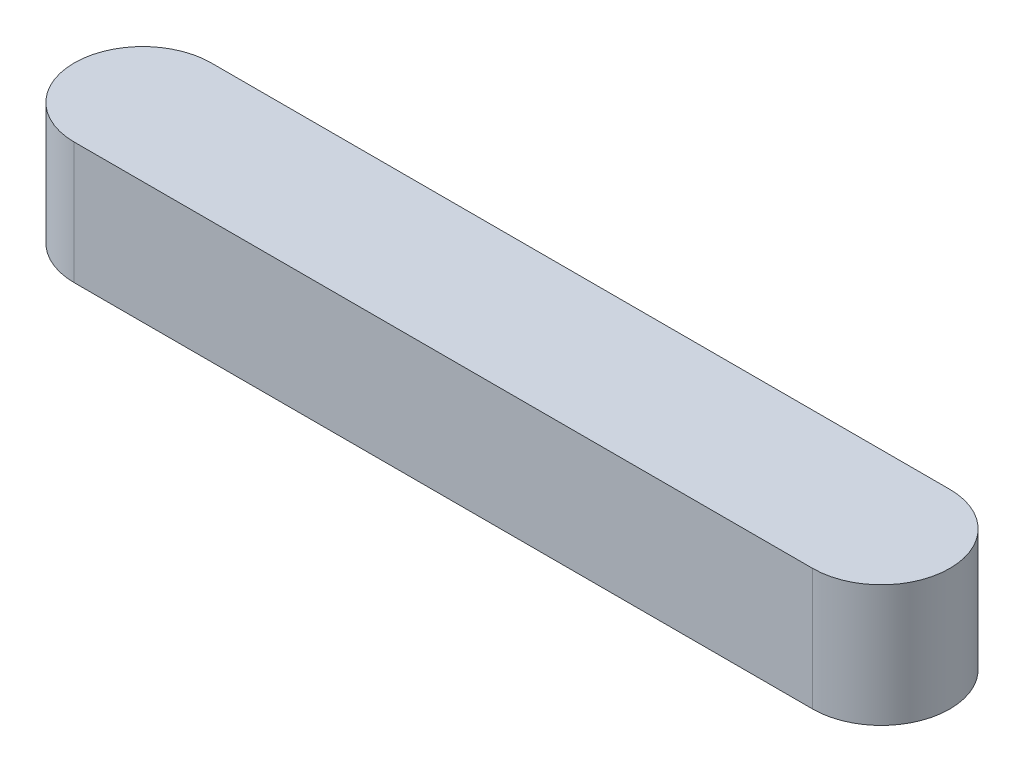
ISO-10303-21;
HEADER;
FILE_DESCRIPTION(('STEP AP214'),'2;1');
FILE_NAME('part.step','',(''),(''),'','','');
FILE_SCHEMA(('AUTOMOTIVE_DESIGN { 1 0 10303 214 1 1 1 1 }'));
ENDSEC;
DATA;
#1=APPLICATION_CONTEXT('core data for automotive mechanical design processes');
#2=APPLICATION_PROTOCOL_DEFINITION('international standard','automotive_design',2000,#1);
#3=PRODUCT_CONTEXT('',#1,'mechanical');
#4=PRODUCT('Part','Part','',(#3));
#5=PRODUCT_RELATED_PRODUCT_CATEGORY('part','',(#4));
#6=PRODUCT_DEFINITION_FORMATION('','',#4);
#7=PRODUCT_DEFINITION_CONTEXT('part definition',#1,'design');
#8=PRODUCT_DEFINITION('design','',#6,#7);
#9=PRODUCT_DEFINITION_SHAPE('','',#8);
#10=(LENGTH_UNIT() NAMED_UNIT(*) SI_UNIT(.MILLI.,.METRE.));
#11=(NAMED_UNIT(*) PLANE_ANGLE_UNIT() SI_UNIT($,.RADIAN.));
#12=(NAMED_UNIT(*) SI_UNIT($,.STERADIAN.) SOLID_ANGLE_UNIT());
#13=UNCERTAINTY_MEASURE_WITH_UNIT(LENGTH_MEASURE(1.E-05),#10,'distance_accuracy_value','');
#14=(GEOMETRIC_REPRESENTATION_CONTEXT(3) GLOBAL_UNCERTAINTY_ASSIGNED_CONTEXT((#13)) GLOBAL_UNIT_ASSIGNED_CONTEXT((#10,
#11,#12)) REPRESENTATION_CONTEXT('',''));
#15=CARTESIAN_POINT('',(0.,0.,0.));
#16=DIRECTION('',(0.,0.,1.));
#17=DIRECTION('',(1.,0.,0.));
#18=AXIS2_PLACEMENT_3D('',#15,#16,#17);
#19=CARTESIAN_POINT('',(-48.5,16.,0.));
#20=DIRECTION('',(0.,-1.,0.));
#21=DIRECTION('',(0.,0.,-1.));
#22=AXIS2_PLACEMENT_3D('',#19,#20,#21);
#23=CYLINDRICAL_SURFACE('',#22,9.00000000000002);
#24=CARTESIAN_POINT('',(-48.5,0.,0.));
#25=DIRECTION('',(0.,1.,0.));
#26=DIRECTION('',(0.,0.,1.));
#27=AXIS2_PLACEMENT_3D('',#24,#25,#26);
#28=CIRCLE('',#27,9.00000000000002);
#29=CARTESIAN_POINT('',(-48.5,0.,-9.00000000000002));
#30=VERTEX_POINT('',#29);
#31=CARTESIAN_POINT('',(-48.5,0.,9.00000000000002));
#32=VERTEX_POINT('',#31);
#33=EDGE_CURVE('E96',#30,#32,#28,.T.);
#34=ORIENTED_EDGE('',*,*,#33,.T.);
#35=DIRECTION('',(0.,-1.,0.));
#36=VECTOR('',#35,1.);
#37=CARTESIAN_POINT('',(-48.5,16.,9.00000000000002));
#38=LINE('',#37,#36);
#39=CARTESIAN_POINT('',(-48.5,16.,9.00000000000002));
#40=VERTEX_POINT('',#39);
#41=EDGE_CURVE('E11',#40,#32,#38,.T.);
#42=ORIENTED_EDGE('',*,*,#41,.F.);
#43=CARTESIAN_POINT('',(-48.5,16.,0.));
#44=DIRECTION('',(0.,1.,0.));
#45=DIRECTION('',(0.,0.,1.));
#46=AXIS2_PLACEMENT_3D('',#43,#44,#45);
#47=CIRCLE('',#46,9.00000000000002);
#48=CARTESIAN_POINT('',(-48.5,16.,-9.00000000000002));
#49=VERTEX_POINT('',#48);
#50=EDGE_CURVE('E84',#49,#40,#47,.T.);
#51=ORIENTED_EDGE('',*,*,#50,.F.);
#52=DIRECTION('',(0.,-1.,0.));
#53=VECTOR('',#52,1.);
#54=CARTESIAN_POINT('',(-48.5,16.,-9.00000000000002));
#55=LINE('',#54,#53);
#56=EDGE_CURVE('E92',#49,#30,#55,.T.);
#57=ORIENTED_EDGE('',*,*,#56,.T.);
#58=EDGE_LOOP('',(#34,#42,#51,#57));
#59=FACE_BOUND('',#58,.T.);
#60=ADVANCED_FACE('F33',(#59),#23,.T.);
#61=CARTESIAN_POINT('',(-48.5,16.,9.00000000000002));
#62=DIRECTION('',(0.,0.,-1.));
#63=DIRECTION('',(-1.,0.,0.));
#64=AXIS2_PLACEMENT_3D('',#61,#62,#63);
#65=PLANE('',#64);
#66=DIRECTION('',(1.,0.,0.));
#67=VECTOR('',#66,1.);
#68=CARTESIAN_POINT('',(-48.5,0.,9.00000000000002));
#69=LINE('',#68,#67);
#70=CARTESIAN_POINT('',(48.5,0.,9.));
#71=VERTEX_POINT('',#70);
#72=EDGE_CURVE('E88',#32,#71,#69,.T.);
#73=ORIENTED_EDGE('',*,*,#72,.T.);
#74=DIRECTION('',(0.,-1.,0.));
#75=VECTOR('',#74,1.);
#76=CARTESIAN_POINT('',(48.5,16.,9.));
#77=LINE('',#76,#75);
#78=CARTESIAN_POINT('',(48.5,16.,9.));
#79=VERTEX_POINT('',#78);
#80=EDGE_CURVE('E41',#79,#71,#77,.T.);
#81=ORIENTED_EDGE('',*,*,#80,.F.);
#82=DIRECTION('',(1.,0.,0.));
#83=VECTOR('',#82,1.);
#84=CARTESIAN_POINT('',(-48.5,16.,9.00000000000002));
#85=LINE('',#84,#83);
#86=EDGE_CURVE('E79',#40,#79,#85,.T.);
#87=ORIENTED_EDGE('',*,*,#86,.F.);
#88=ORIENTED_EDGE('',*,*,#41,.T.);
#89=EDGE_LOOP('',(#73,#81,#87,#88));
#90=FACE_BOUND('',#89,.T.);
#91=ADVANCED_FACE('F87',(#90),#65,.F.);
#92=CARTESIAN_POINT('',(48.5,16.,0.));
#93=DIRECTION('',(0.,-1.,0.));
#94=DIRECTION('',(0.,0.,-1.));
#95=AXIS2_PLACEMENT_3D('',#92,#93,#94);
#96=CYLINDRICAL_SURFACE('',#95,9.00000000000002);
#97=CARTESIAN_POINT('',(48.5,0.,0.));
#98=DIRECTION('',(0.,1.,0.));
#99=DIRECTION('',(0.,0.,1.));
#100=AXIS2_PLACEMENT_3D('',#97,#98,#99);
#101=CIRCLE('',#100,9.00000000000002);
#102=CARTESIAN_POINT('',(48.5,0.,-9.00000000000003));
#103=VERTEX_POINT('',#102);
#104=EDGE_CURVE('E66',#71,#103,#101,.T.);
#105=ORIENTED_EDGE('',*,*,#104,.T.);
#106=DIRECTION('',(0.,-1.,0.));
#107=VECTOR('',#106,1.);
#108=CARTESIAN_POINT('',(48.5,16.,-9.00000000000003));
#109=LINE('',#108,#107);
#110=CARTESIAN_POINT('',(48.5,16.,-9.00000000000003));
#111=VERTEX_POINT('',#110);
#112=EDGE_CURVE('E89',#111,#103,#109,.T.);
#113=ORIENTED_EDGE('',*,*,#112,.F.);
#114=CARTESIAN_POINT('',(48.5,16.,0.));
#115=DIRECTION('',(0.,1.,0.));
#116=DIRECTION('',(0.,0.,1.));
#117=AXIS2_PLACEMENT_3D('',#114,#115,#116);
#118=CIRCLE('',#117,9.00000000000002);
#119=EDGE_CURVE('E82',#79,#111,#118,.T.);
#120=ORIENTED_EDGE('',*,*,#119,.F.);
#121=ORIENTED_EDGE('',*,*,#80,.T.);
#122=EDGE_LOOP('',(#105,#113,#120,#121));
#123=FACE_BOUND('',#122,.T.);
#124=ADVANCED_FACE('F90',(#123),#96,.T.);
#125=CARTESIAN_POINT('',(-48.5,16.,-9.00000000000002));
#126=DIRECTION('',(0.,0.,1.));
#127=DIRECTION('',(1.,0.,0.));
#128=AXIS2_PLACEMENT_3D('',#125,#126,#127);
#129=PLANE('',#128);
#130=DIRECTION('',(-1.,0.,0.));
#131=VECTOR('',#130,1.);
#132=CARTESIAN_POINT('',(-48.5,0.,-9.00000000000002));
#133=LINE('',#132,#131);
#134=EDGE_CURVE('E72',#103,#30,#133,.T.);
#135=ORIENTED_EDGE('',*,*,#134,.T.);
#136=ORIENTED_EDGE('',*,*,#56,.F.);
#137=DIRECTION('',(-1.,0.,0.));
#138=VECTOR('',#137,1.);
#139=CARTESIAN_POINT('',(-48.5,16.,-9.00000000000002));
#140=LINE('',#139,#138);
#141=EDGE_CURVE('E49',#111,#49,#140,.T.);
#142=ORIENTED_EDGE('',*,*,#141,.F.);
#143=ORIENTED_EDGE('',*,*,#112,.T.);
#144=EDGE_LOOP('',(#135,#136,#142,#143));
#145=FACE_BOUND('',#144,.T.);
#146=ADVANCED_FACE('F103',(#145),#129,.F.);
#147=CARTESIAN_POINT('',(-48.5,16.,0.));
#148=DIRECTION('',(0.,1.,0.));
#149=DIRECTION('',(0.,0.,1.));
#150=AXIS2_PLACEMENT_3D('',#147,#148,#149);
#151=PLANE('',#150);
#152=ORIENTED_EDGE('',*,*,#50,.T.);
#153=ORIENTED_EDGE('',*,*,#86,.T.);
#154=ORIENTED_EDGE('',*,*,#119,.T.);
#155=ORIENTED_EDGE('',*,*,#141,.T.);
#156=EDGE_LOOP('',(#152,#153,#154,#155));
#157=FACE_BOUND('',#156,.T.);
#158=ADVANCED_FACE('F80',(#157),#151,.T.);
#159=CARTESIAN_POINT('',(-48.5,0.,0.));
#160=DIRECTION('',(0.,1.,0.));
#161=DIRECTION('',(0.,0.,1.));
#162=AXIS2_PLACEMENT_3D('',#159,#160,#161);
#163=PLANE('',#162);
#164=ORIENTED_EDGE('',*,*,#33,.F.);
#165=ORIENTED_EDGE('',*,*,#134,.F.);
#166=ORIENTED_EDGE('',*,*,#104,.F.);
#167=ORIENTED_EDGE('',*,*,#72,.F.);
#168=EDGE_LOOP('',(#164,#165,#166,#167));
#169=FACE_BOUND('',#168,.T.);
#170=ADVANCED_FACE('F106',(#169),#163,.F.);
#171=CLOSED_SHELL('',(#60,#91,#124,#146,#158,#170));
#172=MANIFOLD_SOLID_BREP('B2',#171);
#173=ADVANCED_BREP_SHAPE_REPRESENTATION('',(#18,#172),#14);
#174=SHAPE_DEFINITION_REPRESENTATION(#9,#173);
ENDSEC;
END-ISO-10303-21;
